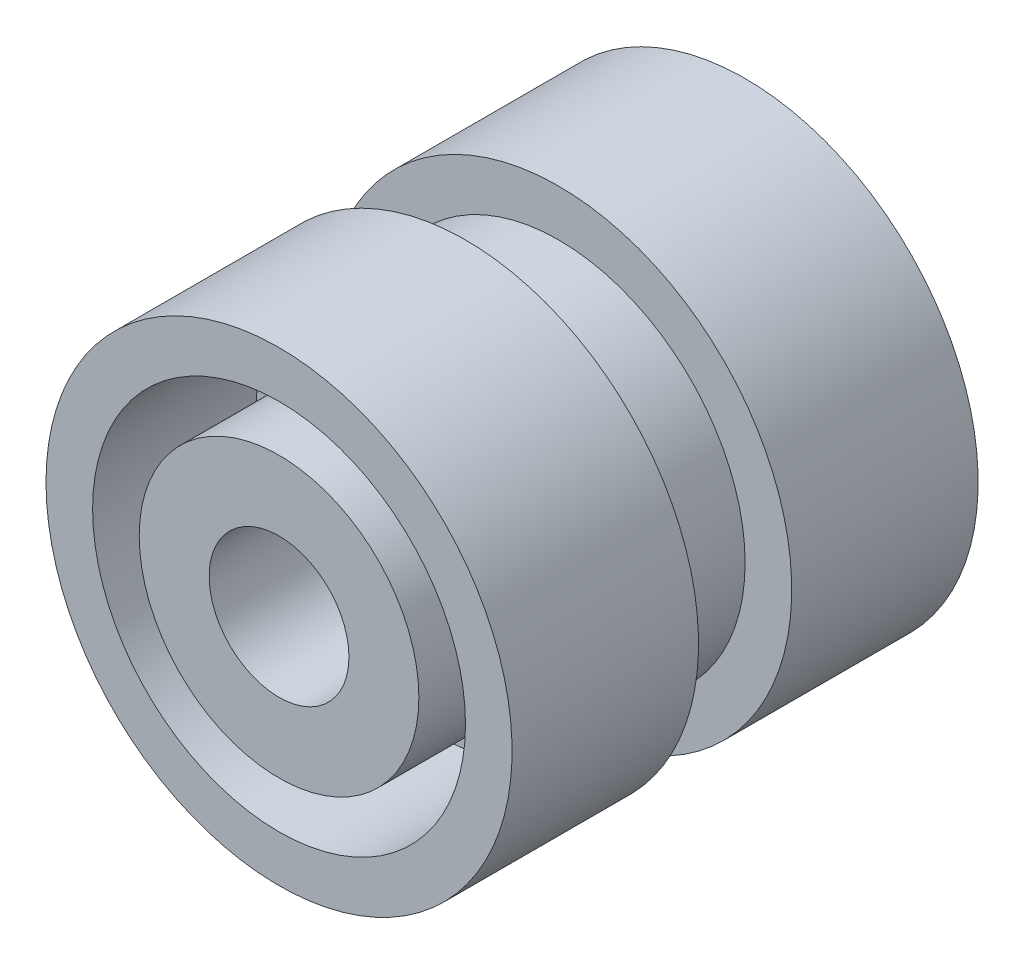
ISO-10303-21;
HEADER;
FILE_DESCRIPTION(('STEP AP214'),'2;1');
FILE_NAME('part.step','',(''),(''),'','','');
FILE_SCHEMA(('AUTOMOTIVE_DESIGN { 1 0 10303 214 1 1 1 1 }'));
ENDSEC;
DATA;
#1=APPLICATION_CONTEXT('core data for automotive mechanical design processes');
#2=APPLICATION_PROTOCOL_DEFINITION('international standard','automotive_design',2000,#1);
#3=PRODUCT_CONTEXT('',#1,'mechanical');
#4=PRODUCT('Part','Part','',(#3));
#5=PRODUCT_RELATED_PRODUCT_CATEGORY('part','',(#4));
#6=PRODUCT_DEFINITION_FORMATION('','',#4);
#7=PRODUCT_DEFINITION_CONTEXT('part definition',#1,'design');
#8=PRODUCT_DEFINITION('design','',#6,#7);
#9=PRODUCT_DEFINITION_SHAPE('','',#8);
#10=(LENGTH_UNIT() NAMED_UNIT(*) SI_UNIT(.MILLI.,.METRE.));
#11=(NAMED_UNIT(*) PLANE_ANGLE_UNIT() SI_UNIT($,.RADIAN.));
#12=(NAMED_UNIT(*) SI_UNIT($,.STERADIAN.) SOLID_ANGLE_UNIT());
#13=UNCERTAINTY_MEASURE_WITH_UNIT(LENGTH_MEASURE(1.E-05),#10,'distance_accuracy_value','');
#14=(GEOMETRIC_REPRESENTATION_CONTEXT(3) GLOBAL_UNCERTAINTY_ASSIGNED_CONTEXT((#13)) GLOBAL_UNIT_ASSIGNED_CONTEXT((#10,
#11,#12)) REPRESENTATION_CONTEXT('',''));
#15=CARTESIAN_POINT('',(0.,0.,0.));
#16=DIRECTION('',(0.,0.,1.));
#17=DIRECTION('',(1.,0.,0.));
#18=AXIS2_PLACEMENT_3D('',#15,#16,#17);
#19=CARTESIAN_POINT('',(0.,4.,-1.5));
#20=DIRECTION('',(0.,0.,-1.));
#21=DIRECTION('',(-1.,0.,0.));
#22=AXIS2_PLACEMENT_3D('',#19,#20,#21);
#23=PLANE('',#22);
#24=CARTESIAN_POINT('',(0.,0.,-1.5));
#25=DIRECTION('',(0.,0.,-1.));
#26=DIRECTION('',(-1.,0.,0.));
#27=AXIS2_PLACEMENT_3D('',#24,#25,#26);
#28=CIRCLE('',#27,2.);
#29=CARTESIAN_POINT('',(1.93649167310371,-0.5,-1.5));
#30=VERTEX_POINT('',#29);
#31=CARTESIAN_POINT('',(0.5,-1.93649167310371,-1.5));
#32=VERTEX_POINT('',#31);
#33=EDGE_CURVE('E47',#30,#32,#28,.T.);
#34=ORIENTED_EDGE('',*,*,#33,.F.);
#35=DIRECTION('',(-1.,0.,0.));
#36=VECTOR('',#35,1.);
#37=CARTESIAN_POINT('',(1.93649167310371,-0.5,-1.5));
#38=LINE('',#37,#36);
#39=CARTESIAN_POINT('',(3.96862696659689,-0.500000000000001,-1.5));
#40=VERTEX_POINT('',#39);
#41=EDGE_CURVE('E250',#40,#30,#38,.T.);
#42=ORIENTED_EDGE('',*,*,#41,.F.);
#43=CARTESIAN_POINT('',(0.,0.,-1.5));
#44=DIRECTION('',(0.,0.,-1.));
#45=DIRECTION('',(-1.,0.,0.));
#46=AXIS2_PLACEMENT_3D('',#43,#44,#45);
#47=CIRCLE('',#46,4.);
#48=CARTESIAN_POINT('',(0.500000000000001,-3.96862696659689,-1.5));
#49=VERTEX_POINT('',#48);
#50=EDGE_CURVE('E173',#40,#49,#47,.T.);
#51=ORIENTED_EDGE('',*,*,#50,.T.);
#52=DIRECTION('',(0.,-1.,0.));
#53=VECTOR('',#52,1.);
#54=CARTESIAN_POINT('',(0.5,-1.93649167310371,-1.5));
#55=LINE('',#54,#53);
#56=EDGE_CURVE('E52',#32,#49,#55,.T.);
#57=ORIENTED_EDGE('',*,*,#56,.F.);
#58=EDGE_LOOP('',(#34,#42,#51,#57));
#59=FACE_BOUND('',#58,.T.);
#60=ADVANCED_FACE('F33',(#59),#23,.T.);
#61=CARTESIAN_POINT('',(0.,0.,-1.5));
#62=DIRECTION('',(0.,0.,-1.));
#63=DIRECTION('',(-1.,0.,0.));
#64=AXIS2_PLACEMENT_3D('',#61,#62,#63);
#65=CIRCLE('',#64,2.);
#66=CARTESIAN_POINT('',(-0.5,-1.93649167310371,-1.5));
#67=VERTEX_POINT('',#66);
#68=CARTESIAN_POINT('',(-1.93649167310371,-0.499999999999999,-1.5));
#69=VERTEX_POINT('',#68);
#70=EDGE_CURVE('E262',#67,#69,#65,.T.);
#71=ORIENTED_EDGE('',*,*,#70,.F.);
#72=DIRECTION('',(0.,1.,0.));
#73=VECTOR('',#72,1.);
#74=CARTESIAN_POINT('',(-0.5,-1.93649167310371,-1.5));
#75=LINE('',#74,#73);
#76=CARTESIAN_POINT('',(-0.5,-3.96862696659689,-1.5));
#77=VERTEX_POINT('',#76);
#78=EDGE_CURVE('E259',#77,#67,#75,.T.);
#79=ORIENTED_EDGE('',*,*,#78,.F.);
#80=CARTESIAN_POINT('',(-3.96862696659689,-0.500000000000001,-1.5));
#81=VERTEX_POINT('',#80);
#82=EDGE_CURVE('E170',#77,#81,#47,.T.);
#83=ORIENTED_EDGE('',*,*,#82,.T.);
#84=DIRECTION('',(-1.,0.,0.));
#85=VECTOR('',#84,1.);
#86=CARTESIAN_POINT('',(-1.93649167310371,-0.5,-1.5));
#87=LINE('',#86,#85);
#88=EDGE_CURVE('E265',#69,#81,#87,.T.);
#89=ORIENTED_EDGE('',*,*,#88,.F.);
#90=EDGE_LOOP('',(#71,#79,#83,#89));
#91=FACE_BOUND('',#90,.T.);
#92=ADVANCED_FACE('F228',(#91),#23,.T.);
#93=CARTESIAN_POINT('',(0.,0.,-1.5));
#94=DIRECTION('',(0.,0.,-1.));
#95=DIRECTION('',(-1.,0.,0.));
#96=AXIS2_PLACEMENT_3D('',#93,#94,#95);
#97=CIRCLE('',#96,2.);
#98=CARTESIAN_POINT('',(-1.93649167310371,0.5,-1.5));
#99=VERTEX_POINT('',#98);
#100=CARTESIAN_POINT('',(-0.5,1.93649167310371,-1.5));
#101=VERTEX_POINT('',#100);
#102=EDGE_CURVE('E271',#99,#101,#97,.T.);
#103=ORIENTED_EDGE('',*,*,#102,.F.);
#104=DIRECTION('',(1.,0.,0.));
#105=VECTOR('',#104,1.);
#106=CARTESIAN_POINT('',(-1.93649167310371,0.5,-1.5));
#107=LINE('',#106,#105);
#108=CARTESIAN_POINT('',(-3.96862696659689,0.5,-1.5));
#109=VERTEX_POINT('',#108);
#110=EDGE_CURVE('E268',#109,#99,#107,.T.);
#111=ORIENTED_EDGE('',*,*,#110,.F.);
#112=CARTESIAN_POINT('',(-0.5,3.96862696659689,-1.5));
#113=VERTEX_POINT('',#112);
#114=EDGE_CURVE('E175',#109,#113,#47,.T.);
#115=ORIENTED_EDGE('',*,*,#114,.T.);
#116=DIRECTION('',(0.,1.,0.));
#117=VECTOR('',#116,1.);
#118=CARTESIAN_POINT('',(-0.5,1.93649167310371,-1.5));
#119=LINE('',#118,#117);
#120=EDGE_CURVE('E274',#101,#113,#119,.T.);
#121=ORIENTED_EDGE('',*,*,#120,.F.);
#122=EDGE_LOOP('',(#103,#111,#115,#121));
#123=FACE_BOUND('',#122,.T.);
#124=ADVANCED_FACE('F233',(#123),#23,.T.);
#125=CARTESIAN_POINT('',(0.5,3.96862696659689,-1.5));
#126=VERTEX_POINT('',#125);
#127=CARTESIAN_POINT('',(3.96862696659689,0.499999999999999,-1.5));
#128=VERTEX_POINT('',#127);
#129=EDGE_CURVE('E182',#126,#128,#47,.T.);
#130=ORIENTED_EDGE('',*,*,#129,.T.);
#131=DIRECTION('',(1.,0.,0.));
#132=VECTOR('',#131,1.);
#133=CARTESIAN_POINT('',(1.93649167310371,0.5,-1.5));
#134=LINE('',#133,#132);
#135=CARTESIAN_POINT('',(1.93649167310371,0.5,-1.5));
#136=VERTEX_POINT('',#135);
#137=EDGE_CURVE('E246',#136,#128,#134,.T.);
#138=ORIENTED_EDGE('',*,*,#137,.F.);
#139=CARTESIAN_POINT('',(0.,0.,-1.5));
#140=DIRECTION('',(0.,0.,-1.));
#141=DIRECTION('',(-1.,0.,0.));
#142=AXIS2_PLACEMENT_3D('',#139,#140,#141);
#143=CIRCLE('',#142,2.);
#144=CARTESIAN_POINT('',(0.5,1.93649167310371,-1.5));
#145=VERTEX_POINT('',#144);
#146=EDGE_CURVE('E169',#145,#136,#143,.T.);
#147=ORIENTED_EDGE('',*,*,#146,.F.);
#148=DIRECTION('',(0.,-1.,0.));
#149=VECTOR('',#148,1.);
#150=CARTESIAN_POINT('',(0.5,1.93649167310371,-1.5));
#151=LINE('',#150,#149);
#152=EDGE_CURVE('E166',#126,#145,#151,.T.);
#153=ORIENTED_EDGE('',*,*,#152,.F.);
#154=EDGE_LOOP('',(#130,#138,#147,#153));
#155=FACE_BOUND('',#154,.T.);
#156=ADVANCED_FACE('F229',(#155),#23,.T.);
#157=CARTESIAN_POINT('',(0.,0.,0.));
#158=DIRECTION('',(0.,0.,-1.));
#159=DIRECTION('',(-1.,0.,0.));
#160=AXIS2_PLACEMENT_3D('',#157,#158,#159);
#161=CYLINDRICAL_SURFACE('',#160,4.);
#162=CARTESIAN_POINT('',(0.,0.,-5.));
#163=DIRECTION('',(0.,0.,-1.));
#164=DIRECTION('',(-1.,0.,0.));
#165=AXIS2_PLACEMENT_3D('',#162,#163,#164);
#166=CIRCLE('',#165,4.);
#167=CARTESIAN_POINT('',(-4.,0.,-5.));
#168=VERTEX_POINT('',#167);
#169=EDGE_CURVE('E181',#168,#168,#166,.T.);
#170=ORIENTED_EDGE('',*,*,#169,.T.);
#171=EDGE_LOOP('',(#170));
#172=FACE_BOUND('',#171,.T.);
#173=CARTESIAN_POINT('',(0.,0.,-3.5));
#174=DIRECTION('',(0.,0.,-1.));
#175=DIRECTION('',(-1.,0.,0.));
#176=AXIS2_PLACEMENT_3D('',#173,#174,#175);
#177=CIRCLE('',#176,4.);
#178=CARTESIAN_POINT('',(-0.5,3.96862696659689,-3.5));
#179=VERTEX_POINT('',#178);
#180=CARTESIAN_POINT('',(0.5,3.96862696659689,-3.5));
#181=VERTEX_POINT('',#180);
#182=EDGE_CURVE('E346',#179,#181,#177,.T.);
#183=ORIENTED_EDGE('',*,*,#182,.F.);
#184=DIRECTION('',(0.,0.,1.));
#185=VECTOR('',#184,1.);
#186=CARTESIAN_POINT('',(-0.5,3.96862696659689,-3.5));
#187=LINE('',#186,#185);
#188=EDGE_CURVE('E282',#179,#113,#187,.T.);
#189=ORIENTED_EDGE('',*,*,#188,.T.);
#190=ORIENTED_EDGE('',*,*,#114,.F.);
#191=DIRECTION('',(0.,0.,1.));
#192=VECTOR('',#191,1.);
#193=CARTESIAN_POINT('',(-3.96862696659689,0.5,-3.5));
#194=LINE('',#193,#192);
#195=CARTESIAN_POINT('',(-3.96862696659689,0.5,-3.5));
#196=VERTEX_POINT('',#195);
#197=EDGE_CURVE('E290',#196,#109,#194,.T.);
#198=ORIENTED_EDGE('',*,*,#197,.F.);
#199=CARTESIAN_POINT('',(0.,0.,-3.5));
#200=DIRECTION('',(0.,0.,-1.));
#201=DIRECTION('',(-1.,0.,0.));
#202=AXIS2_PLACEMENT_3D('',#199,#200,#201);
#203=CIRCLE('',#202,4.);
#204=CARTESIAN_POINT('',(-3.96862696659689,-0.5,-3.5));
#205=VERTEX_POINT('',#204);
#206=EDGE_CURVE('E336',#205,#196,#203,.T.);
#207=ORIENTED_EDGE('',*,*,#206,.F.);
#208=DIRECTION('',(0.,0.,1.));
#209=VECTOR('',#208,1.);
#210=CARTESIAN_POINT('',(-3.96862696659689,-0.500000000000001,-3.5));
#211=LINE('',#210,#209);
#212=EDGE_CURVE('E293',#205,#81,#211,.T.);
#213=ORIENTED_EDGE('',*,*,#212,.T.);
#214=ORIENTED_EDGE('',*,*,#82,.F.);
#215=DIRECTION('',(0.,0.,1.));
#216=VECTOR('',#215,1.);
#217=CARTESIAN_POINT('',(-0.5,-3.96862696659689,-3.5));
#218=LINE('',#217,#216);
#219=CARTESIAN_POINT('',(-0.5,-3.96862696659689,-3.5));
#220=VERTEX_POINT('',#219);
#221=EDGE_CURVE('E301',#220,#77,#218,.T.);
#222=ORIENTED_EDGE('',*,*,#221,.F.);
#223=CARTESIAN_POINT('',(0.,0.,-3.5));
#224=DIRECTION('',(0.,0.,-1.));
#225=DIRECTION('',(-1.,0.,0.));
#226=AXIS2_PLACEMENT_3D('',#223,#224,#225);
#227=CIRCLE('',#226,4.);
#228=CARTESIAN_POINT('',(0.5,-3.96862696659689,-3.5));
#229=VERTEX_POINT('',#228);
#230=EDGE_CURVE('E326',#229,#220,#227,.T.);
#231=ORIENTED_EDGE('',*,*,#230,.F.);
#232=DIRECTION('',(0.,0.,1.));
#233=VECTOR('',#232,1.);
#234=CARTESIAN_POINT('',(0.500000000000001,-3.96862696659689,-3.5));
#235=LINE('',#234,#233);
#236=EDGE_CURVE('E304',#229,#49,#235,.T.);
#237=ORIENTED_EDGE('',*,*,#236,.T.);
#238=ORIENTED_EDGE('',*,*,#50,.F.);
#239=DIRECTION('',(0.,0.,1.));
#240=VECTOR('',#239,1.);
#241=CARTESIAN_POINT('',(3.96862696659689,-0.500000000000001,-3.5));
#242=LINE('',#241,#240);
#243=CARTESIAN_POINT('',(3.96862696659689,-0.500000000000001,-3.5));
#244=VERTEX_POINT('',#243);
#245=EDGE_CURVE('E176',#244,#40,#242,.T.);
#246=ORIENTED_EDGE('',*,*,#245,.F.);
#247=CARTESIAN_POINT('',(0.,0.,-3.5));
#248=DIRECTION('',(0.,0.,-1.));
#249=DIRECTION('',(-1.,0.,0.));
#250=AXIS2_PLACEMENT_3D('',#247,#248,#249);
#251=CIRCLE('',#250,4.);
#252=CARTESIAN_POINT('',(3.96862696659689,0.499999999999999,-3.5));
#253=VERTEX_POINT('',#252);
#254=EDGE_CURVE('E155',#253,#244,#251,.T.);
#255=ORIENTED_EDGE('',*,*,#254,.F.);
#256=DIRECTION('',(0.,0.,1.));
#257=VECTOR('',#256,1.);
#258=CARTESIAN_POINT('',(3.96862696659689,0.499999999999999,-3.5));
#259=LINE('',#258,#257);
#260=EDGE_CURVE('E152',#253,#128,#259,.T.);
#261=ORIENTED_EDGE('',*,*,#260,.T.);
#262=ORIENTED_EDGE('',*,*,#129,.F.);
#263=DIRECTION('',(0.,0.,1.));
#264=VECTOR('',#263,1.);
#265=CARTESIAN_POINT('',(0.5,3.96862696659689,-3.5));
#266=LINE('',#265,#264);
#267=EDGE_CURVE('E280',#181,#126,#266,.T.);
#268=ORIENTED_EDGE('',*,*,#267,.F.);
#269=EDGE_LOOP('',(#183,#189,#190,#198,#207,#213,#214,#222,#231,#237,#238,#246,#255,#261,#262,#268));
#270=FACE_BOUND('',#269,.T.);
#271=ADVANCED_FACE('F225',(#172,#270),#161,.F.);
#272=CARTESIAN_POINT('',(0.,0.,5.));
#273=DIRECTION('',(0.,0.,1.));
#274=DIRECTION('',(1.,0.,0.));
#275=AXIS2_PLACEMENT_3D('',#272,#273,#274);
#276=PLANE('',#275);
#277=CARTESIAN_POINT('',(0.,0.,5.));
#278=DIRECTION('',(0.,0.,1.));
#279=DIRECTION('',(1.,0.,0.));
#280=AXIS2_PLACEMENT_3D('',#277,#278,#279);
#281=CIRCLE('',#280,1.5);
#282=CARTESIAN_POINT('',(1.5,0.,5.));
#283=VERTEX_POINT('',#282);
#284=EDGE_CURVE('E563',#283,#283,#281,.T.);
#285=ORIENTED_EDGE('',*,*,#284,.F.);
#286=EDGE_LOOP('',(#285));
#287=FACE_BOUND('',#286,.T.);
#288=CARTESIAN_POINT('',(0.,0.,5.));
#289=DIRECTION('',(0.,0.,-1.));
#290=DIRECTION('',(-1.,0.,0.));
#291=AXIS2_PLACEMENT_3D('',#288,#289,#290);
#292=CIRCLE('',#291,3.);
#293=CARTESIAN_POINT('',(-3.,0.,5.));
#294=VERTEX_POINT('',#293);
#295=EDGE_CURVE('E11',#294,#294,#292,.T.);
#296=ORIENTED_EDGE('',*,*,#295,.F.);
#297=EDGE_LOOP('',(#296));
#298=FACE_BOUND('',#297,.T.);
#299=ADVANCED_FACE('F216',(#287,#298),#276,.T.);
#300=CARTESIAN_POINT('',(0.,0.,0.));
#301=DIRECTION('',(0.,0.,-1.));
#302=DIRECTION('',(-1.,0.,0.));
#303=AXIS2_PLACEMENT_3D('',#300,#301,#302);
#304=CYLINDRICAL_SURFACE('',#303,3.);
#305=ORIENTED_EDGE('',*,*,#295,.T.);
#306=EDGE_LOOP('',(#305));
#307=FACE_BOUND('',#306,.T.);
#308=CARTESIAN_POINT('',(0.,0.,1.5));
#309=DIRECTION('',(0.,0.,-1.));
#310=DIRECTION('',(-1.,0.,0.));
#311=AXIS2_PLACEMENT_3D('',#308,#309,#310);
#312=CIRCLE('',#311,3.);
#313=CARTESIAN_POINT('',(-3.,0.,1.5));
#314=VERTEX_POINT('',#313);
#315=EDGE_CURVE('E40',#314,#314,#312,.T.);
#316=ORIENTED_EDGE('',*,*,#315,.F.);
#317=EDGE_LOOP('',(#316));
#318=FACE_BOUND('',#317,.T.);
#319=ADVANCED_FACE('F214',(#307,#318),#304,.T.);
#320=CARTESIAN_POINT('',(0.,3.,1.5));
#321=DIRECTION('',(0.,0.,1.));
#322=DIRECTION('',(1.,0.,0.));
#323=AXIS2_PLACEMENT_3D('',#320,#321,#322);
#324=PLANE('',#323);
#325=ORIENTED_EDGE('',*,*,#315,.T.);
#326=EDGE_LOOP('',(#325));
#327=FACE_BOUND('',#326,.T.);
#328=CARTESIAN_POINT('',(0.,0.,1.5));
#329=DIRECTION('',(0.,0.,-1.));
#330=DIRECTION('',(-1.,0.,0.));
#331=AXIS2_PLACEMENT_3D('',#328,#329,#330);
#332=CIRCLE('',#331,4.);
#333=CARTESIAN_POINT('',(-4.,0.,1.5));
#334=VERTEX_POINT('',#333);
#335=EDGE_CURVE('E206',#334,#334,#332,.T.);
#336=ORIENTED_EDGE('',*,*,#335,.F.);
#337=EDGE_LOOP('',(#336));
#338=FACE_BOUND('',#337,.T.);
#339=ADVANCED_FACE('F211',(#327,#338),#324,.T.);
#340=CARTESIAN_POINT('',(0.,0.,0.));
#341=DIRECTION('',(0.,0.,-1.));
#342=DIRECTION('',(-1.,0.,0.));
#343=AXIS2_PLACEMENT_3D('',#340,#341,#342);
#344=CYLINDRICAL_SURFACE('',#343,4.);
#345=ORIENTED_EDGE('',*,*,#335,.T.);
#346=EDGE_LOOP('',(#345));
#347=FACE_BOUND('',#346,.T.);
#348=CARTESIAN_POINT('',(0.,0.,5.));
#349=DIRECTION('',(0.,0.,-1.));
#350=DIRECTION('',(-1.,0.,0.));
#351=AXIS2_PLACEMENT_3D('',#348,#349,#350);
#352=CIRCLE('',#351,4.);
#353=CARTESIAN_POINT('',(-4.,0.,5.));
#354=VERTEX_POINT('',#353);
#355=EDGE_CURVE('E203',#354,#354,#352,.T.);
#356=ORIENTED_EDGE('',*,*,#355,.F.);
#357=EDGE_LOOP('',(#356));
#358=FACE_BOUND('',#357,.T.);
#359=ADVANCED_FACE('F223',(#347,#358),#344,.F.);
#360=CARTESIAN_POINT('',(0.,4.,5.));
#361=DIRECTION('',(0.,0.,1.));
#362=DIRECTION('',(1.,0.,0.));
#363=AXIS2_PLACEMENT_3D('',#360,#361,#362);
#364=PLANE('',#363);
#365=ORIENTED_EDGE('',*,*,#355,.T.);
#366=EDGE_LOOP('',(#365));
#367=FACE_BOUND('',#366,.T.);
#368=CARTESIAN_POINT('',(0.,0.,5.));
#369=DIRECTION('',(0.,0.,-1.));
#370=DIRECTION('',(-1.,0.,0.));
#371=AXIS2_PLACEMENT_3D('',#368,#369,#370);
#372=CIRCLE('',#371,5.);
#373=CARTESIAN_POINT('',(-5.,0.,5.));
#374=VERTEX_POINT('',#373);
#375=EDGE_CURVE('E200',#374,#374,#372,.T.);
#376=ORIENTED_EDGE('',*,*,#375,.F.);
#377=EDGE_LOOP('',(#376));
#378=FACE_BOUND('',#377,.T.);
#379=ADVANCED_FACE('F421',(#367,#378),#364,.T.);
#380=CARTESIAN_POINT('',(0.,0.,0.));
#381=DIRECTION('',(0.,0.,-1.));
#382=DIRECTION('',(-1.,0.,0.));
#383=AXIS2_PLACEMENT_3D('',#380,#381,#382);
#384=CYLINDRICAL_SURFACE('',#383,5.);
#385=ORIENTED_EDGE('',*,*,#375,.T.);
#386=EDGE_LOOP('',(#385));
#387=FACE_BOUND('',#386,.T.);
#388=CARTESIAN_POINT('',(0.,0.,1.));
#389=DIRECTION('',(0.,0.,-1.));
#390=DIRECTION('',(-1.,0.,0.));
#391=AXIS2_PLACEMENT_3D('',#388,#389,#390);
#392=CIRCLE('',#391,5.);
#393=CARTESIAN_POINT('',(-5.,0.,1.));
#394=VERTEX_POINT('',#393);
#395=EDGE_CURVE('E197',#394,#394,#392,.T.);
#396=ORIENTED_EDGE('',*,*,#395,.F.);
#397=EDGE_LOOP('',(#396));
#398=FACE_BOUND('',#397,.T.);
#399=ADVANCED_FACE('F417',(#387,#398),#384,.T.);
#400=CARTESIAN_POINT('',(0.,5.,1.));
#401=DIRECTION('',(0.,0.,-1.));
#402=DIRECTION('',(-1.,0.,0.));
#403=AXIS2_PLACEMENT_3D('',#400,#401,#402);
#404=PLANE('',#403);
#405=ORIENTED_EDGE('',*,*,#395,.T.);
#406=EDGE_LOOP('',(#405));
#407=FACE_BOUND('',#406,.T.);
#408=CARTESIAN_POINT('',(0.,0.,1.));
#409=DIRECTION('',(0.,0.,-1.));
#410=DIRECTION('',(-1.,0.,0.));
#411=AXIS2_PLACEMENT_3D('',#408,#409,#410);
#412=CIRCLE('',#411,4.);
#413=CARTESIAN_POINT('',(-4.,0.,1.));
#414=VERTEX_POINT('',#413);
#415=EDGE_CURVE('E194',#414,#414,#412,.T.);
#416=ORIENTED_EDGE('',*,*,#415,.F.);
#417=EDGE_LOOP('',(#416));
#418=FACE_BOUND('',#417,.T.);
#419=ADVANCED_FACE('F413',(#407,#418),#404,.T.);
#420=CARTESIAN_POINT('',(0.,0.,0.));
#421=DIRECTION('',(0.,0.,-1.));
#422=DIRECTION('',(-1.,0.,0.));
#423=AXIS2_PLACEMENT_3D('',#420,#421,#422);
#424=CYLINDRICAL_SURFACE('',#423,4.);
#425=ORIENTED_EDGE('',*,*,#415,.T.);
#426=EDGE_LOOP('',(#425));
#427=FACE_BOUND('',#426,.T.);
#428=CARTESIAN_POINT('',(0.,0.,-1.));
#429=DIRECTION('',(0.,0.,-1.));
#430=DIRECTION('',(-1.,0.,0.));
#431=AXIS2_PLACEMENT_3D('',#428,#429,#430);
#432=CIRCLE('',#431,4.);
#433=CARTESIAN_POINT('',(-4.,0.,-1.));
#434=VERTEX_POINT('',#433);
#435=EDGE_CURVE('E191',#434,#434,#432,.T.);
#436=ORIENTED_EDGE('',*,*,#435,.F.);
#437=EDGE_LOOP('',(#436));
#438=FACE_BOUND('',#437,.T.);
#439=ADVANCED_FACE('F409',(#427,#438),#424,.T.);
#440=CARTESIAN_POINT('',(0.,5.,-1.));
#441=DIRECTION('',(0.,0.,1.));
#442=DIRECTION('',(1.,0.,0.));
#443=AXIS2_PLACEMENT_3D('',#440,#441,#442);
#444=PLANE('',#443);
#445=ORIENTED_EDGE('',*,*,#435,.T.);
#446=EDGE_LOOP('',(#445));
#447=FACE_BOUND('',#446,.T.);
#448=CARTESIAN_POINT('',(0.,0.,-1.));
#449=DIRECTION('',(0.,0.,-1.));
#450=DIRECTION('',(-1.,0.,0.));
#451=AXIS2_PLACEMENT_3D('',#448,#449,#450);
#452=CIRCLE('',#451,5.);
#453=CARTESIAN_POINT('',(-5.,0.,-1.));
#454=VERTEX_POINT('',#453);
#455=EDGE_CURVE('E188',#454,#454,#452,.T.);
#456=ORIENTED_EDGE('',*,*,#455,.F.);
#457=EDGE_LOOP('',(#456));
#458=FACE_BOUND('',#457,.T.);
#459=ADVANCED_FACE('F405',(#447,#458),#444,.T.);
#460=CARTESIAN_POINT('',(0.,0.,0.));
#461=DIRECTION('',(0.,0.,-1.));
#462=DIRECTION('',(-1.,0.,0.));
#463=AXIS2_PLACEMENT_3D('',#460,#461,#462);
#464=CYLINDRICAL_SURFACE('',#463,5.);
#465=ORIENTED_EDGE('',*,*,#455,.T.);
#466=EDGE_LOOP('',(#465));
#467=FACE_BOUND('',#466,.T.);
#468=CARTESIAN_POINT('',(0.,0.,-5.));
#469=DIRECTION('',(0.,0.,-1.));
#470=DIRECTION('',(-1.,0.,0.));
#471=AXIS2_PLACEMENT_3D('',#468,#469,#470);
#472=CIRCLE('',#471,5.);
#473=CARTESIAN_POINT('',(-5.,0.,-5.));
#474=VERTEX_POINT('',#473);
#475=EDGE_CURVE('E185',#474,#474,#472,.T.);
#476=ORIENTED_EDGE('',*,*,#475,.F.);
#477=EDGE_LOOP('',(#476));
#478=FACE_BOUND('',#477,.T.);
#479=ADVANCED_FACE('F401',(#467,#478),#464,.T.);
#480=CARTESIAN_POINT('',(0.,4.,-5.));
#481=DIRECTION('',(0.,0.,-1.));
#482=DIRECTION('',(-1.,0.,0.));
#483=AXIS2_PLACEMENT_3D('',#480,#481,#482);
#484=PLANE('',#483);
#485=ORIENTED_EDGE('',*,*,#475,.T.);
#486=EDGE_LOOP('',(#485));
#487=FACE_BOUND('',#486,.T.);
#488=ORIENTED_EDGE('',*,*,#169,.F.);
#489=EDGE_LOOP('',(#488));
#490=FACE_BOUND('',#489,.T.);
#491=ADVANCED_FACE('F397',(#487,#490),#484,.T.);
#492=CARTESIAN_POINT('',(0.,0.,-3.5));
#493=DIRECTION('',(0.,0.,1.));
#494=DIRECTION('',(1.,0.,0.));
#495=AXIS2_PLACEMENT_3D('',#492,#493,#494);
#496=CYLINDRICAL_SURFACE('',#495,2.);
#497=ORIENTED_EDGE('',*,*,#146,.T.);
#498=DIRECTION('',(0.,0.,1.));
#499=VECTOR('',#498,1.);
#500=CARTESIAN_POINT('',(1.93649167310371,0.5,-3.5));
#501=LINE('',#500,#499);
#502=CARTESIAN_POINT('',(1.93649167310371,0.5,-3.5));
#503=VERTEX_POINT('',#502);
#504=EDGE_CURVE('E150',#503,#136,#501,.T.);
#505=ORIENTED_EDGE('',*,*,#504,.F.);
#506=CARTESIAN_POINT('',(0.,0.,-3.5));
#507=DIRECTION('',(0.,0.,-1.));
#508=DIRECTION('',(-1.,0.,0.));
#509=AXIS2_PLACEMENT_3D('',#506,#507,#508);
#510=CIRCLE('',#509,2.);
#511=CARTESIAN_POINT('',(0.5,1.93649167310371,-3.5));
#512=VERTEX_POINT('',#511);
#513=EDGE_CURVE('E156',#512,#503,#510,.T.);
#514=ORIENTED_EDGE('',*,*,#513,.F.);
#515=DIRECTION('',(0.,0.,1.));
#516=VECTOR('',#515,1.);
#517=CARTESIAN_POINT('',(0.5,1.93649167310371,-3.5));
#518=LINE('',#517,#516);
#519=EDGE_CURVE('E278',#512,#145,#518,.T.);
#520=ORIENTED_EDGE('',*,*,#519,.T.);
#521=EDGE_LOOP('',(#497,#505,#514,#520));
#522=FACE_BOUND('',#521,.T.);
#523=ADVANCED_FACE('F168',(#522),#496,.T.);
#524=CARTESIAN_POINT('',(1.93649167310371,0.5,-3.5));
#525=DIRECTION('',(0.,-1.,0.));
#526=DIRECTION('',(1.,0.,0.));
#527=AXIS2_PLACEMENT_3D('',#524,#525,#526);
#528=PLANE('',#527);
#529=ORIENTED_EDGE('',*,*,#137,.T.);
#530=ORIENTED_EDGE('',*,*,#260,.F.);
#531=DIRECTION('',(1.,0.,0.));
#532=VECTOR('',#531,1.);
#533=CARTESIAN_POINT('',(1.93649167310371,0.5,-3.5));
#534=LINE('',#533,#532);
#535=EDGE_CURVE('E145',#503,#253,#534,.T.);
#536=ORIENTED_EDGE('',*,*,#535,.F.);
#537=ORIENTED_EDGE('',*,*,#504,.T.);
#538=EDGE_LOOP('',(#529,#530,#536,#537));
#539=FACE_BOUND('',#538,.T.);
#540=ADVANCED_FACE('F148',(#539),#528,.F.);
#541=CARTESIAN_POINT('',(1.93649167310371,-0.5,-3.5));
#542=DIRECTION('',(0.,1.,0.));
#543=DIRECTION('',(-1.,0.,0.));
#544=AXIS2_PLACEMENT_3D('',#541,#542,#543);
#545=PLANE('',#544);
#546=ORIENTED_EDGE('',*,*,#41,.T.);
#547=DIRECTION('',(0.,0.,1.));
#548=VECTOR('',#547,1.);
#549=CARTESIAN_POINT('',(1.93649167310371,-0.5,-3.5));
#550=LINE('',#549,#548);
#551=CARTESIAN_POINT('',(1.93649167310371,-0.5,-3.5));
#552=VERTEX_POINT('',#551);
#553=EDGE_CURVE('E309',#552,#30,#550,.T.);
#554=ORIENTED_EDGE('',*,*,#553,.F.);
#555=DIRECTION('',(-1.,0.,0.));
#556=VECTOR('',#555,1.);
#557=CARTESIAN_POINT('',(1.93649167310371,-0.5,-3.5));
#558=LINE('',#557,#556);
#559=EDGE_CURVE('E316',#244,#552,#558,.T.);
#560=ORIENTED_EDGE('',*,*,#559,.F.);
#561=ORIENTED_EDGE('',*,*,#245,.T.);
#562=EDGE_LOOP('',(#546,#554,#560,#561));
#563=FACE_BOUND('',#562,.T.);
#564=ADVANCED_FACE('F314',(#563),#545,.F.);
#565=CARTESIAN_POINT('',(0.,0.,-3.5));
#566=DIRECTION('',(0.,0.,1.));
#567=DIRECTION('',(1.,0.,0.));
#568=AXIS2_PLACEMENT_3D('',#565,#566,#567);
#569=CYLINDRICAL_SURFACE('',#568,2.);
#570=ORIENTED_EDGE('',*,*,#33,.T.);
#571=DIRECTION('',(0.,0.,1.));
#572=VECTOR('',#571,1.);
#573=CARTESIAN_POINT('',(0.5,-1.93649167310371,-3.5));
#574=LINE('',#573,#572);
#575=CARTESIAN_POINT('',(0.5,-1.93649167310371,-3.5));
#576=VERTEX_POINT('',#575);
#577=EDGE_CURVE('E306',#576,#32,#574,.T.);
#578=ORIENTED_EDGE('',*,*,#577,.F.);
#579=CARTESIAN_POINT('',(0.,0.,-3.5));
#580=DIRECTION('',(0.,0.,-1.));
#581=DIRECTION('',(-1.,0.,0.));
#582=AXIS2_PLACEMENT_3D('',#579,#580,#581);
#583=CIRCLE('',#582,2.);
#584=EDGE_CURVE('E319',#552,#576,#583,.T.);
#585=ORIENTED_EDGE('',*,*,#584,.F.);
#586=ORIENTED_EDGE('',*,*,#553,.T.);
#587=EDGE_LOOP('',(#570,#578,#585,#586));
#588=FACE_BOUND('',#587,.T.);
#589=ADVANCED_FACE('F387',(#588),#569,.T.);
#590=CARTESIAN_POINT('',(0.5,-1.93649167310371,-3.5));
#591=DIRECTION('',(-1.,0.,0.));
#592=DIRECTION('',(0.,-1.,0.));
#593=AXIS2_PLACEMENT_3D('',#590,#591,#592);
#594=PLANE('',#593);
#595=ORIENTED_EDGE('',*,*,#56,.T.);
#596=ORIENTED_EDGE('',*,*,#236,.F.);
#597=DIRECTION('',(0.,-1.,0.));
#598=VECTOR('',#597,1.);
#599=CARTESIAN_POINT('',(0.5,-1.93649167310371,-3.5));
#600=LINE('',#599,#598);
#601=EDGE_CURVE('E323',#576,#229,#600,.T.);
#602=ORIENTED_EDGE('',*,*,#601,.F.);
#603=ORIENTED_EDGE('',*,*,#577,.T.);
#604=EDGE_LOOP('',(#595,#596,#602,#603));
#605=FACE_BOUND('',#604,.T.);
#606=ADVANCED_FACE('F383',(#605),#594,.F.);
#607=CARTESIAN_POINT('',(-0.5,-1.93649167310371,-3.5));
#608=DIRECTION('',(1.,0.,0.));
#609=DIRECTION('',(0.,1.,0.));
#610=AXIS2_PLACEMENT_3D('',#607,#608,#609);
#611=PLANE('',#610);
#612=ORIENTED_EDGE('',*,*,#78,.T.);
#613=DIRECTION('',(0.,0.,1.));
#614=VECTOR('',#613,1.);
#615=CARTESIAN_POINT('',(-0.5,-1.93649167310371,-3.5));
#616=LINE('',#615,#614);
#617=CARTESIAN_POINT('',(-0.5,-1.93649167310371,-3.5));
#618=VERTEX_POINT('',#617);
#619=EDGE_CURVE('E298',#618,#67,#616,.T.);
#620=ORIENTED_EDGE('',*,*,#619,.F.);
#621=DIRECTION('',(0.,1.,0.));
#622=VECTOR('',#621,1.);
#623=CARTESIAN_POINT('',(-0.5,-1.93649167310371,-3.5));
#624=LINE('',#623,#622);
#625=EDGE_CURVE('E329',#220,#618,#624,.T.);
#626=ORIENTED_EDGE('',*,*,#625,.F.);
#627=ORIENTED_EDGE('',*,*,#221,.T.);
#628=EDGE_LOOP('',(#612,#620,#626,#627));
#629=FACE_BOUND('',#628,.T.);
#630=ADVANCED_FACE('F379',(#629),#611,.F.);
#631=CARTESIAN_POINT('',(0.,0.,-3.5));
#632=DIRECTION('',(0.,0.,1.));
#633=DIRECTION('',(1.,0.,0.));
#634=AXIS2_PLACEMENT_3D('',#631,#632,#633);
#635=CYLINDRICAL_SURFACE('',#634,2.);
#636=ORIENTED_EDGE('',*,*,#70,.T.);
#637=DIRECTION('',(0.,0.,1.));
#638=VECTOR('',#637,1.);
#639=CARTESIAN_POINT('',(-1.93649167310371,-0.5,-3.5));
#640=LINE('',#639,#638);
#641=CARTESIAN_POINT('',(-1.93649167310371,-0.5,-3.5));
#642=VERTEX_POINT('',#641);
#643=EDGE_CURVE('E295',#642,#69,#640,.T.);
#644=ORIENTED_EDGE('',*,*,#643,.F.);
#645=CARTESIAN_POINT('',(0.,0.,-3.5));
#646=DIRECTION('',(0.,0.,-1.));
#647=DIRECTION('',(-1.,0.,0.));
#648=AXIS2_PLACEMENT_3D('',#645,#646,#647);
#649=CIRCLE('',#648,2.);
#650=EDGE_CURVE('E331',#618,#642,#649,.T.);
#651=ORIENTED_EDGE('',*,*,#650,.F.);
#652=ORIENTED_EDGE('',*,*,#619,.T.);
#653=EDGE_LOOP('',(#636,#644,#651,#652));
#654=FACE_BOUND('',#653,.T.);
#655=ADVANCED_FACE('F375',(#654),#635,.T.);
#656=CARTESIAN_POINT('',(-1.93649167310371,-0.5,-3.5));
#657=DIRECTION('',(0.,1.,0.));
#658=DIRECTION('',(-1.,0.,0.));
#659=AXIS2_PLACEMENT_3D('',#656,#657,#658);
#660=PLANE('',#659);
#661=ORIENTED_EDGE('',*,*,#88,.T.);
#662=ORIENTED_EDGE('',*,*,#212,.F.);
#663=DIRECTION('',(-1.,0.,0.));
#664=VECTOR('',#663,1.);
#665=CARTESIAN_POINT('',(-1.93649167310371,-0.5,-3.5));
#666=LINE('',#665,#664);
#667=EDGE_CURVE('E333',#642,#205,#666,.T.);
#668=ORIENTED_EDGE('',*,*,#667,.F.);
#669=ORIENTED_EDGE('',*,*,#643,.T.);
#670=EDGE_LOOP('',(#661,#662,#668,#669));
#671=FACE_BOUND('',#670,.T.);
#672=ADVANCED_FACE('F371',(#671),#660,.F.);
#673=CARTESIAN_POINT('',(-1.93649167310371,0.5,-3.5));
#674=DIRECTION('',(0.,-1.,0.));
#675=DIRECTION('',(1.,0.,0.));
#676=AXIS2_PLACEMENT_3D('',#673,#674,#675);
#677=PLANE('',#676);
#678=ORIENTED_EDGE('',*,*,#110,.T.);
#679=DIRECTION('',(0.,0.,1.));
#680=VECTOR('',#679,1.);
#681=CARTESIAN_POINT('',(-1.93649167310371,0.5,-3.5));
#682=LINE('',#681,#680);
#683=CARTESIAN_POINT('',(-1.93649167310371,0.5,-3.5));
#684=VERTEX_POINT('',#683);
#685=EDGE_CURVE('E287',#684,#99,#682,.T.);
#686=ORIENTED_EDGE('',*,*,#685,.F.);
#687=DIRECTION('',(1.,0.,0.));
#688=VECTOR('',#687,1.);
#689=CARTESIAN_POINT('',(-1.93649167310371,0.5,-3.5));
#690=LINE('',#689,#688);
#691=EDGE_CURVE('E339',#196,#684,#690,.T.);
#692=ORIENTED_EDGE('',*,*,#691,.F.);
#693=ORIENTED_EDGE('',*,*,#197,.T.);
#694=EDGE_LOOP('',(#678,#686,#692,#693));
#695=FACE_BOUND('',#694,.T.);
#696=ADVANCED_FACE('F367',(#695),#677,.F.);
#697=CARTESIAN_POINT('',(0.,0.,-3.5));
#698=DIRECTION('',(0.,0.,1.));
#699=DIRECTION('',(1.,0.,0.));
#700=AXIS2_PLACEMENT_3D('',#697,#698,#699);
#701=CYLINDRICAL_SURFACE('',#700,2.);
#702=ORIENTED_EDGE('',*,*,#102,.T.);
#703=DIRECTION('',(0.,0.,1.));
#704=VECTOR('',#703,1.);
#705=CARTESIAN_POINT('',(-0.5,1.93649167310371,-3.5));
#706=LINE('',#705,#704);
#707=CARTESIAN_POINT('',(-0.5,1.93649167310371,-3.5));
#708=VERTEX_POINT('',#707);
#709=EDGE_CURVE('E284',#708,#101,#706,.T.);
#710=ORIENTED_EDGE('',*,*,#709,.F.);
#711=CARTESIAN_POINT('',(0.,0.,-3.5));
#712=DIRECTION('',(0.,0.,-1.));
#713=DIRECTION('',(-1.,0.,0.));
#714=AXIS2_PLACEMENT_3D('',#711,#712,#713);
#715=CIRCLE('',#714,2.);
#716=EDGE_CURVE('E341',#684,#708,#715,.T.);
#717=ORIENTED_EDGE('',*,*,#716,.F.);
#718=ORIENTED_EDGE('',*,*,#685,.T.);
#719=EDGE_LOOP('',(#702,#710,#717,#718));
#720=FACE_BOUND('',#719,.T.);
#721=ADVANCED_FACE('F360',(#720),#701,.T.);
#722=CARTESIAN_POINT('',(-0.5,1.93649167310371,-3.5));
#723=DIRECTION('',(1.,0.,0.));
#724=DIRECTION('',(0.,0.,-1.));
#725=AXIS2_PLACEMENT_3D('',#722,#723,#724);
#726=PLANE('',#725);
#727=ORIENTED_EDGE('',*,*,#120,.T.);
#728=ORIENTED_EDGE('',*,*,#188,.F.);
#729=DIRECTION('',(0.,1.,0.));
#730=VECTOR('',#729,1.);
#731=CARTESIAN_POINT('',(-0.5,1.93649167310371,-3.5));
#732=LINE('',#731,#730);
#733=EDGE_CURVE('E343',#708,#179,#732,.T.);
#734=ORIENTED_EDGE('',*,*,#733,.F.);
#735=ORIENTED_EDGE('',*,*,#709,.T.);
#736=EDGE_LOOP('',(#727,#728,#734,#735));
#737=FACE_BOUND('',#736,.T.);
#738=ADVANCED_FACE('F352',(#737),#726,.F.);
#739=CARTESIAN_POINT('',(0.5,1.93649167310371,-3.5));
#740=DIRECTION('',(-1.,0.,0.));
#741=DIRECTION('',(0.,0.,1.));
#742=AXIS2_PLACEMENT_3D('',#739,#740,#741);
#743=PLANE('',#742);
#744=ORIENTED_EDGE('',*,*,#152,.T.);
#745=ORIENTED_EDGE('',*,*,#519,.F.);
#746=DIRECTION('',(0.,-1.,0.));
#747=VECTOR('',#746,1.);
#748=CARTESIAN_POINT('',(0.5,1.93649167310371,-3.5));
#749=LINE('',#748,#747);
#750=EDGE_CURVE('E162',#181,#512,#749,.T.);
#751=ORIENTED_EDGE('',*,*,#750,.F.);
#752=ORIENTED_EDGE('',*,*,#267,.T.);
#753=EDGE_LOOP('',(#744,#745,#751,#752));
#754=FACE_BOUND('',#753,.T.);
#755=ADVANCED_FACE('F350',(#754),#743,.F.);
#756=CARTESIAN_POINT('',(0.,0.,-3.5));
#757=DIRECTION('',(0.,0.,-1.));
#758=DIRECTION('',(-1.,0.,0.));
#759=AXIS2_PLACEMENT_3D('',#756,#757,#758);
#760=PLANE('',#759);
#761=ORIENTED_EDGE('',*,*,#513,.T.);
#762=ORIENTED_EDGE('',*,*,#535,.T.);
#763=ORIENTED_EDGE('',*,*,#254,.T.);
#764=ORIENTED_EDGE('',*,*,#559,.T.);
#765=ORIENTED_EDGE('',*,*,#584,.T.);
#766=ORIENTED_EDGE('',*,*,#601,.T.);
#767=ORIENTED_EDGE('',*,*,#230,.T.);
#768=ORIENTED_EDGE('',*,*,#625,.T.);
#769=ORIENTED_EDGE('',*,*,#650,.T.);
#770=ORIENTED_EDGE('',*,*,#667,.T.);
#771=ORIENTED_EDGE('',*,*,#206,.T.);
#772=ORIENTED_EDGE('',*,*,#691,.T.);
#773=ORIENTED_EDGE('',*,*,#716,.T.);
#774=ORIENTED_EDGE('',*,*,#733,.T.);
#775=ORIENTED_EDGE('',*,*,#182,.T.);
#776=ORIENTED_EDGE('',*,*,#750,.T.);
#777=EDGE_LOOP('',(#761,#762,#763,#764,#765,#766,#767,#768,#769,#770,#771,#772,#773,#774,#775,#776));
#778=FACE_BOUND('',#777,.T.);
#779=ADVANCED_FACE('F159',(#778),#760,.T.);
#780=CARTESIAN_POINT('',(0.,0.,-3.));
#781=DIRECTION('',(0.,0.,1.));
#782=DIRECTION('',(1.,0.,0.));
#783=AXIS2_PLACEMENT_3D('',#780,#781,#782);
#784=CYLINDRICAL_SURFACE('',#783,1.5);
#785=CARTESIAN_POINT('',(0.,0.,-3.));
#786=DIRECTION('',(0.,0.,1.));
#787=DIRECTION('',(1.,0.,0.));
#788=AXIS2_PLACEMENT_3D('',#785,#786,#787);
#789=CIRCLE('',#788,1.5);
#790=CARTESIAN_POINT('',(1.5,0.,-3.));
#791=VERTEX_POINT('',#790);
#792=EDGE_CURVE('E253',#791,#791,#789,.T.);
#793=ORIENTED_EDGE('',*,*,#792,.F.);
#794=EDGE_LOOP('',(#793));
#795=FACE_BOUND('',#794,.T.);
#796=ORIENTED_EDGE('',*,*,#284,.T.);
#797=EDGE_LOOP('',(#796));
#798=FACE_BOUND('',#797,.T.);
#799=ADVANCED_FACE('F358',(#795,#798),#784,.F.);
#800=CARTESIAN_POINT('',(0.,0.,-3.));
#801=DIRECTION('',(0.,0.,1.));
#802=DIRECTION('',(1.,0.,0.));
#803=AXIS2_PLACEMENT_3D('',#800,#801,#802);
#804=PLANE('',#803);
#805=ORIENTED_EDGE('',*,*,#792,.T.);
#806=EDGE_LOOP('',(#805));
#807=FACE_BOUND('',#806,.T.);
#808=ADVANCED_FACE('F548',(#807),#804,.T.);
#809=CLOSED_SHELL('',(#60,#92,#124,#156,#271,#299,#319,#339,#359,#379,#399,#419,#439,#459,#479,
#491,#523,#540,#564,#589,#606,#630,#655,#672,#696,#721,#738,#755,#779,#799,#808));
#810=MANIFOLD_SOLID_BREP('B2',#809);
#811=ADVANCED_BREP_SHAPE_REPRESENTATION('',(#18,#810),#14);
#812=SHAPE_DEFINITION_REPRESENTATION(#9,#811);
ENDSEC;
END-ISO-10303-21;
